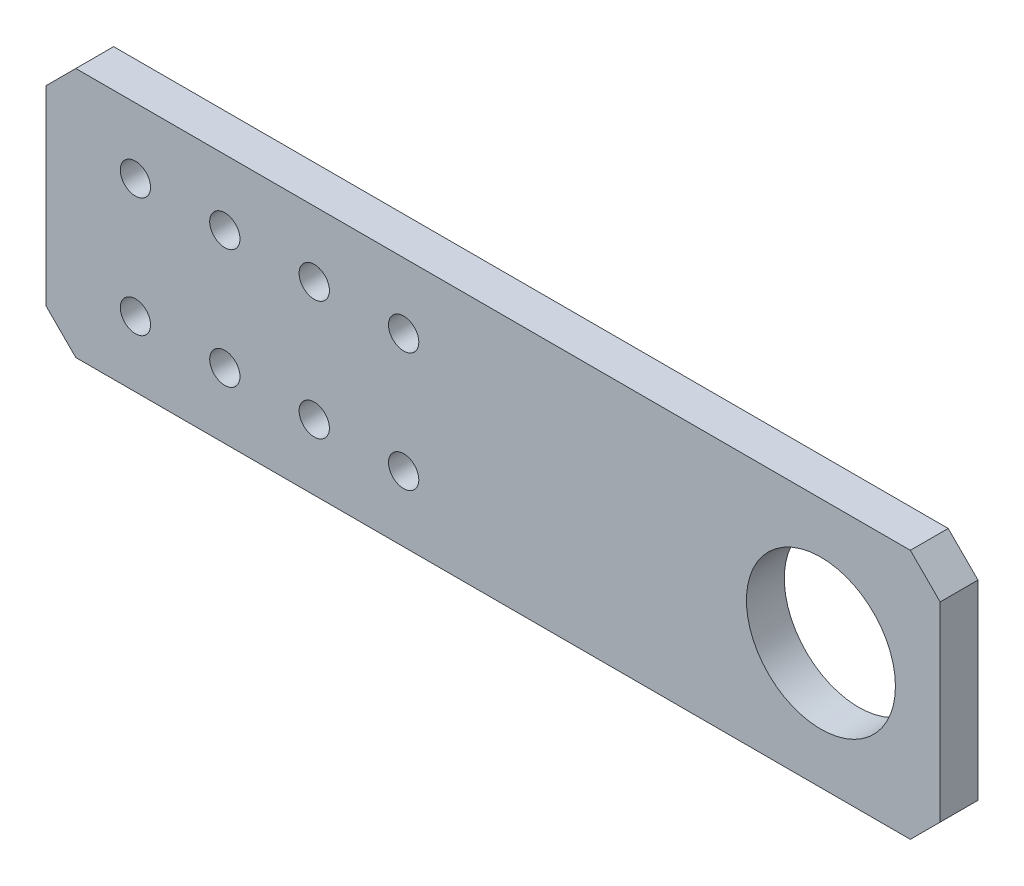
ISO-10303-21;
HEADER;
FILE_DESCRIPTION(('STEP AP214'),'2;1');
FILE_NAME('part.step','',(''),(''),'','','');
FILE_SCHEMA(('AUTOMOTIVE_DESIGN { 1 0 10303 214 1 1 1 1 }'));
ENDSEC;
DATA;
#1=APPLICATION_CONTEXT('core data for automotive mechanical design processes');
#2=APPLICATION_PROTOCOL_DEFINITION('international standard','automotive_design',2000,#1);
#3=PRODUCT_CONTEXT('',#1,'mechanical');
#4=PRODUCT('Part','Part','',(#3));
#5=PRODUCT_RELATED_PRODUCT_CATEGORY('part','',(#4));
#6=PRODUCT_DEFINITION_FORMATION('','',#4);
#7=PRODUCT_DEFINITION_CONTEXT('part definition',#1,'design');
#8=PRODUCT_DEFINITION('design','',#6,#7);
#9=PRODUCT_DEFINITION_SHAPE('','',#8);
#10=(LENGTH_UNIT() NAMED_UNIT(*) SI_UNIT(.MILLI.,.METRE.));
#11=(NAMED_UNIT(*) PLANE_ANGLE_UNIT() SI_UNIT($,.RADIAN.));
#12=(NAMED_UNIT(*) SI_UNIT($,.STERADIAN.) SOLID_ANGLE_UNIT());
#13=UNCERTAINTY_MEASURE_WITH_UNIT(LENGTH_MEASURE(1.E-05),#10,'distance_accuracy_value','');
#14=(GEOMETRIC_REPRESENTATION_CONTEXT(3) GLOBAL_UNCERTAINTY_ASSIGNED_CONTEXT((#13)) GLOBAL_UNIT_ASSIGNED_CONTEXT((#10,
#11,#12)) REPRESENTATION_CONTEXT('',''));
#15=CARTESIAN_POINT('',(0.,0.,0.));
#16=DIRECTION('',(0.,0.,1.));
#17=DIRECTION('',(1.,0.,0.));
#18=AXIS2_PLACEMENT_3D('',#15,#16,#17);
#19=CARTESIAN_POINT('',(-100.,21.,6.35));
#20=DIRECTION('',(0.,-1.,0.));
#21=DIRECTION('',(0.,0.,-1.));
#22=AXIS2_PLACEMENT_3D('',#19,#20,#21);
#23=PLANE('',#22);
#24=DIRECTION('',(0.,0.,1.));
#25=VECTOR('',#24,1.);
#26=CARTESIAN_POINT('',(-45.,21.,-3.65));
#27=LINE('',#26,#25);
#28=CARTESIAN_POINT('',(-45.,21.,0.));
#29=VERTEX_POINT('',#28);
#30=CARTESIAN_POINT('',(-45.,21.,6.35));
#31=VERTEX_POINT('',#30);
#32=EDGE_CURVE('E121',#29,#31,#27,.T.);
#33=ORIENTED_EDGE('',*,*,#32,.T.);
#34=DIRECTION('',(-1.,0.,0.));
#35=VECTOR('',#34,1.);
#36=CARTESIAN_POINT('',(-100.,21.,6.35));
#37=LINE('',#36,#35);
#38=CARTESIAN_POINT('',(95.,21.,6.35));
#39=VERTEX_POINT('',#38);
#40=EDGE_CURVE('E159',#39,#31,#37,.T.);
#41=ORIENTED_EDGE('',*,*,#40,.F.);
#42=DIRECTION('',(0.,0.,-1.));
#43=VECTOR('',#42,1.);
#44=CARTESIAN_POINT('',(95.,21.,6.35));
#45=LINE('',#44,#43);
#46=CARTESIAN_POINT('',(95.,21.,0.));
#47=VERTEX_POINT('',#46);
#48=EDGE_CURVE('E174',#39,#47,#45,.T.);
#49=ORIENTED_EDGE('',*,*,#48,.T.);
#50=DIRECTION('',(-1.,0.,0.));
#51=VECTOR('',#50,1.);
#52=CARTESIAN_POINT('',(-100.,21.,0.));
#53=LINE('',#52,#51);
#54=EDGE_CURVE('E166',#47,#29,#53,.T.);
#55=ORIENTED_EDGE('',*,*,#54,.T.);
#56=EDGE_LOOP('',(#33,#41,#49,#55));
#57=FACE_BOUND('',#56,.T.);
#58=ADVANCED_FACE('F33',(#57),#23,.F.);
#59=CARTESIAN_POINT('',(-100.,-21.,6.35));
#60=DIRECTION('',(0.,1.,0.));
#61=DIRECTION('',(0.,0.,1.));
#62=AXIS2_PLACEMENT_3D('',#59,#60,#61);
#63=PLANE('',#62);
#64=DIRECTION('',(0.,0.,1.));
#65=VECTOR('',#64,1.);
#66=CARTESIAN_POINT('',(-45.,-21.,-3.65));
#67=LINE('',#66,#65);
#68=CARTESIAN_POINT('',(-45.,-21.,0.));
#69=VERTEX_POINT('',#68);
#70=CARTESIAN_POINT('',(-45.,-21.,6.35));
#71=VERTEX_POINT('',#70);
#72=EDGE_CURVE('E111',#69,#71,#67,.T.);
#73=ORIENTED_EDGE('',*,*,#72,.F.);
#74=DIRECTION('',(1.,0.,0.));
#75=VECTOR('',#74,1.);
#76=CARTESIAN_POINT('',(-100.,-21.,0.));
#77=LINE('',#76,#75);
#78=CARTESIAN_POINT('',(95.,-21.,0.));
#79=VERTEX_POINT('',#78);
#80=EDGE_CURVE('E160',#69,#79,#77,.T.);
#81=ORIENTED_EDGE('',*,*,#80,.T.);
#82=DIRECTION('',(0.,0.,1.));
#83=VECTOR('',#82,1.);
#84=CARTESIAN_POINT('',(95.,-21.,6.35));
#85=LINE('',#84,#83);
#86=CARTESIAN_POINT('',(95.,-21.,6.35));
#87=VERTEX_POINT('',#86);
#88=EDGE_CURVE('E181',#79,#87,#85,.T.);
#89=ORIENTED_EDGE('',*,*,#88,.T.);
#90=DIRECTION('',(1.,0.,0.));
#91=VECTOR('',#90,1.);
#92=CARTESIAN_POINT('',(-100.,-21.,6.35));
#93=LINE('',#92,#91);
#94=EDGE_CURVE('E56',#71,#87,#93,.T.);
#95=ORIENTED_EDGE('',*,*,#94,.F.);
#96=EDGE_LOOP('',(#73,#81,#89,#95));
#97=FACE_BOUND('',#96,.T.);
#98=ADVANCED_FACE('F218',(#97),#63,.F.);
#99=CARTESIAN_POINT('',(0.,0.,6.35));
#100=DIRECTION('',(0.,0.,1.));
#101=DIRECTION('',(1.,0.,0.));
#102=AXIS2_PLACEMENT_3D('',#99,#100,#101);
#103=PLANE('',#102);
#104=CARTESIAN_POINT('',(80.,0.,6.35));
#105=DIRECTION('',(0.,0.,1.));
#106=DIRECTION('',(1.,0.,0.));
#107=AXIS2_PLACEMENT_3D('',#104,#105,#106);
#108=CIRCLE('',#107,12.5);
#109=CARTESIAN_POINT('',(92.5,0.,6.35));
#110=VERTEX_POINT('',#109);
#111=EDGE_CURVE('E152',#110,#110,#108,.T.);
#112=ORIENTED_EDGE('',*,*,#111,.F.);
#113=EDGE_LOOP('',(#112));
#114=FACE_BOUND('',#113,.T.);
#115=CARTESIAN_POINT('',(-34.9999999999998,-10.,6.35));
#116=DIRECTION('',(0.,0.,1.));
#117=DIRECTION('',(1.,0.,0.));
#118=AXIS2_PLACEMENT_3D('',#115,#116,#117);
#119=CIRCLE('',#118,2.54);
#120=CARTESIAN_POINT('',(-32.4599999999998,-10.,6.35));
#121=VERTEX_POINT('',#120);
#122=EDGE_CURVE('E112',#121,#121,#119,.T.);
#123=ORIENTED_EDGE('',*,*,#122,.F.);
#124=EDGE_LOOP('',(#123));
#125=FACE_BOUND('',#124,.T.);
#126=CARTESIAN_POINT('',(-35.,10.,6.35));
#127=DIRECTION('',(0.,0.,1.));
#128=DIRECTION('',(1.,0.,0.));
#129=AXIS2_PLACEMENT_3D('',#126,#127,#128);
#130=CIRCLE('',#129,2.54);
#131=CARTESIAN_POINT('',(-32.46,10.,6.35));
#132=VERTEX_POINT('',#131);
#133=EDGE_CURVE('E140',#132,#132,#130,.T.);
#134=ORIENTED_EDGE('',*,*,#133,.F.);
#135=EDGE_LOOP('',(#134));
#136=FACE_BOUND('',#135,.T.);
#137=CARTESIAN_POINT('',(-20.,10.,6.35));
#138=DIRECTION('',(0.,0.,1.));
#139=DIRECTION('',(1.,0.,0.));
#140=AXIS2_PLACEMENT_3D('',#137,#138,#139);
#141=CIRCLE('',#140,2.54);
#142=CARTESIAN_POINT('',(-17.46,10.,6.35));
#143=VERTEX_POINT('',#142);
#144=EDGE_CURVE('E143',#143,#143,#141,.T.);
#145=ORIENTED_EDGE('',*,*,#144,.F.);
#146=EDGE_LOOP('',(#145));
#147=FACE_BOUND('',#146,.T.);
#148=CARTESIAN_POINT('',(-5.,10.,6.35));
#149=DIRECTION('',(0.,0.,1.));
#150=DIRECTION('',(1.,0.,0.));
#151=AXIS2_PLACEMENT_3D('',#148,#149,#150);
#152=CIRCLE('',#151,2.54);
#153=CARTESIAN_POINT('',(-2.46,10.,6.35));
#154=VERTEX_POINT('',#153);
#155=EDGE_CURVE('E128',#154,#154,#152,.T.);
#156=ORIENTED_EDGE('',*,*,#155,.F.);
#157=EDGE_LOOP('',(#156));
#158=FACE_BOUND('',#157,.T.);
#159=CARTESIAN_POINT('',(10.,10.,6.35));
#160=DIRECTION('',(0.,0.,1.));
#161=DIRECTION('',(1.,0.,0.));
#162=AXIS2_PLACEMENT_3D('',#159,#160,#161);
#163=CIRCLE('',#162,2.54);
#164=CARTESIAN_POINT('',(12.54,10.,6.35));
#165=VERTEX_POINT('',#164);
#166=EDGE_CURVE('E125',#165,#165,#163,.T.);
#167=ORIENTED_EDGE('',*,*,#166,.F.);
#168=EDGE_LOOP('',(#167));
#169=FACE_BOUND('',#168,.T.);
#170=CARTESIAN_POINT('',(10.0000000000002,-10.,6.35));
#171=DIRECTION('',(0.,0.,1.));
#172=DIRECTION('',(1.,0.,0.));
#173=AXIS2_PLACEMENT_3D('',#170,#171,#172);
#174=CIRCLE('',#173,2.54);
#175=CARTESIAN_POINT('',(12.5400000000002,-10.,6.35));
#176=VERTEX_POINT('',#175);
#177=EDGE_CURVE('E129',#176,#176,#174,.T.);
#178=ORIENTED_EDGE('',*,*,#177,.F.);
#179=EDGE_LOOP('',(#178));
#180=FACE_BOUND('',#179,.T.);
#181=CARTESIAN_POINT('',(-4.99999999999979,-10.,6.35));
#182=DIRECTION('',(0.,0.,1.));
#183=DIRECTION('',(1.,0.,0.));
#184=AXIS2_PLACEMENT_3D('',#181,#182,#183);
#185=CIRCLE('',#184,2.54);
#186=CARTESIAN_POINT('',(-2.45999999999979,-10.,6.35));
#187=VERTEX_POINT('',#186);
#188=EDGE_CURVE('E132',#187,#187,#185,.T.);
#189=ORIENTED_EDGE('',*,*,#188,.F.);
#190=EDGE_LOOP('',(#189));
#191=FACE_BOUND('',#190,.T.);
#192=CARTESIAN_POINT('',(-19.9999999999998,-10.,6.35));
#193=DIRECTION('',(0.,0.,1.));
#194=DIRECTION('',(1.,0.,0.));
#195=AXIS2_PLACEMENT_3D('',#192,#193,#194);
#196=CIRCLE('',#195,2.54);
#197=CARTESIAN_POINT('',(-17.4599999999998,-10.,6.35));
#198=VERTEX_POINT('',#197);
#199=EDGE_CURVE('E135',#198,#198,#196,.T.);
#200=ORIENTED_EDGE('',*,*,#199,.F.);
#201=EDGE_LOOP('',(#200));
#202=FACE_BOUND('',#201,.T.);
#203=DIRECTION('',(0.,-1.,0.));
#204=VECTOR('',#203,1.);
#205=CARTESIAN_POINT('',(-50.,0.,6.35));
#206=LINE('',#205,#204);
#207=CARTESIAN_POINT('',(-50.,16.,6.35));
#208=VERTEX_POINT('',#207);
#209=CARTESIAN_POINT('',(-50.,-16.,6.35));
#210=VERTEX_POINT('',#209);
#211=EDGE_CURVE('E100',#208,#210,#206,.T.);
#212=ORIENTED_EDGE('',*,*,#211,.T.);
#213=DIRECTION('',(0.707106781186547,-0.707106781186548,0.));
#214=VECTOR('',#213,1.);
#215=CARTESIAN_POINT('',(-33.,-33.,6.35));
#216=LINE('',#215,#214);
#217=EDGE_CURVE('E108',#210,#71,#216,.T.);
#218=ORIENTED_EDGE('',*,*,#217,.T.);
#219=ORIENTED_EDGE('',*,*,#94,.T.);
#220=DIRECTION('',(-0.707106781186549,-0.707106781186546,0.));
#221=VECTOR('',#220,1.);
#222=CARTESIAN_POINT('',(57.9999999999997,-58.,6.35));
#223=LINE('',#222,#221);
#224=CARTESIAN_POINT('',(100.,-16.,6.35));
#225=VERTEX_POINT('',#224);
#226=EDGE_CURVE('E177',#87,#225,#223,.F.);
#227=ORIENTED_EDGE('',*,*,#226,.T.);
#228=DIRECTION('',(0.,1.,0.));
#229=VECTOR('',#228,1.);
#230=CARTESIAN_POINT('',(100.,21.,6.35));
#231=LINE('',#230,#229);
#232=CARTESIAN_POINT('',(100.,16.,6.35));
#233=VERTEX_POINT('',#232);
#234=EDGE_CURVE('E156',#225,#233,#231,.T.);
#235=ORIENTED_EDGE('',*,*,#234,.T.);
#236=DIRECTION('',(0.707106781186546,-0.707106781186549,0.));
#237=VECTOR('',#236,1.);
#238=CARTESIAN_POINT('',(58.0000000000003,58.,6.35));
#239=LINE('',#238,#237);
#240=EDGE_CURVE('E179',#233,#39,#239,.F.);
#241=ORIENTED_EDGE('',*,*,#240,.T.);
#242=ORIENTED_EDGE('',*,*,#40,.T.);
#243=DIRECTION('',(-0.707106781186547,-0.707106781186548,0.));
#244=VECTOR('',#243,1.);
#245=CARTESIAN_POINT('',(-33.,33.,6.35));
#246=LINE('',#245,#244);
#247=EDGE_CURVE('E106',#31,#208,#246,.T.);
#248=ORIENTED_EDGE('',*,*,#247,.T.);
#249=EDGE_LOOP('',(#212,#218,#219,#227,#235,#241,#242,#248));
#250=FACE_BOUND('',#249,.T.);
#251=ADVANCED_FACE('F114',(#114,#125,#136,#147,#158,#169,#180,#191,#202,#250),#103,.T.);
#252=CARTESIAN_POINT('',(0.,0.,0.));
#253=DIRECTION('',(0.,0.,1.));
#254=DIRECTION('',(1.,0.,0.));
#255=AXIS2_PLACEMENT_3D('',#252,#253,#254);
#256=PLANE('',#255);
#257=CARTESIAN_POINT('',(80.,0.,0.));
#258=DIRECTION('',(0.,0.,1.));
#259=DIRECTION('',(1.,0.,0.));
#260=AXIS2_PLACEMENT_3D('',#257,#258,#259);
#261=CIRCLE('',#260,12.5);
#262=CARTESIAN_POINT('',(92.5,0.,0.));
#263=VERTEX_POINT('',#262);
#264=EDGE_CURVE('E148',#263,#263,#261,.T.);
#265=ORIENTED_EDGE('',*,*,#264,.T.);
#266=EDGE_LOOP('',(#265));
#267=FACE_BOUND('',#266,.T.);
#268=CARTESIAN_POINT('',(-34.9999999999998,-10.,0.));
#269=DIRECTION('',(0.,0.,1.));
#270=DIRECTION('',(1.,0.,0.));
#271=AXIS2_PLACEMENT_3D('',#268,#269,#270);
#272=CIRCLE('',#271,2.54);
#273=CARTESIAN_POINT('',(-32.4599999999998,-10.,0.));
#274=VERTEX_POINT('',#273);
#275=EDGE_CURVE('E120',#274,#274,#272,.T.);
#276=ORIENTED_EDGE('',*,*,#275,.T.);
#277=EDGE_LOOP('',(#276));
#278=FACE_BOUND('',#277,.T.);
#279=CARTESIAN_POINT('',(-35.,10.,0.));
#280=DIRECTION('',(0.,0.,1.));
#281=DIRECTION('',(1.,0.,0.));
#282=AXIS2_PLACEMENT_3D('',#279,#280,#281);
#283=CIRCLE('',#282,2.54);
#284=CARTESIAN_POINT('',(-32.46,10.,0.));
#285=VERTEX_POINT('',#284);
#286=EDGE_CURVE('E190',#285,#285,#283,.T.);
#287=ORIENTED_EDGE('',*,*,#286,.T.);
#288=EDGE_LOOP('',(#287));
#289=FACE_BOUND('',#288,.T.);
#290=CARTESIAN_POINT('',(-20.,10.,0.));
#291=DIRECTION('',(0.,0.,1.));
#292=DIRECTION('',(1.,0.,0.));
#293=AXIS2_PLACEMENT_3D('',#290,#291,#292);
#294=CIRCLE('',#293,2.54);
#295=CARTESIAN_POINT('',(-17.46,10.,0.));
#296=VERTEX_POINT('',#295);
#297=EDGE_CURVE('E193',#296,#296,#294,.T.);
#298=ORIENTED_EDGE('',*,*,#297,.T.);
#299=EDGE_LOOP('',(#298));
#300=FACE_BOUND('',#299,.T.);
#301=CARTESIAN_POINT('',(-5.,10.,0.));
#302=DIRECTION('',(0.,0.,1.));
#303=DIRECTION('',(1.,0.,0.));
#304=AXIS2_PLACEMENT_3D('',#301,#302,#303);
#305=CIRCLE('',#304,2.54);
#306=CARTESIAN_POINT('',(-2.46,10.,0.));
#307=VERTEX_POINT('',#306);
#308=EDGE_CURVE('E196',#307,#307,#305,.T.);
#309=ORIENTED_EDGE('',*,*,#308,.T.);
#310=EDGE_LOOP('',(#309));
#311=FACE_BOUND('',#310,.T.);
#312=CARTESIAN_POINT('',(10.,10.,0.));
#313=DIRECTION('',(0.,0.,1.));
#314=DIRECTION('',(1.,0.,0.));
#315=AXIS2_PLACEMENT_3D('',#312,#313,#314);
#316=CIRCLE('',#315,2.54);
#317=CARTESIAN_POINT('',(12.54,10.,0.));
#318=VERTEX_POINT('',#317);
#319=EDGE_CURVE('E199',#318,#318,#316,.T.);
#320=ORIENTED_EDGE('',*,*,#319,.T.);
#321=EDGE_LOOP('',(#320));
#322=FACE_BOUND('',#321,.T.);
#323=CARTESIAN_POINT('',(10.0000000000002,-10.,0.));
#324=DIRECTION('',(0.,0.,1.));
#325=DIRECTION('',(1.,0.,0.));
#326=AXIS2_PLACEMENT_3D('',#323,#324,#325);
#327=CIRCLE('',#326,2.54);
#328=CARTESIAN_POINT('',(12.5400000000002,-10.,0.));
#329=VERTEX_POINT('',#328);
#330=EDGE_CURVE('E202',#329,#329,#327,.T.);
#331=ORIENTED_EDGE('',*,*,#330,.T.);
#332=EDGE_LOOP('',(#331));
#333=FACE_BOUND('',#332,.T.);
#334=CARTESIAN_POINT('',(-4.99999999999979,-10.,0.));
#335=DIRECTION('',(0.,0.,1.));
#336=DIRECTION('',(1.,0.,0.));
#337=AXIS2_PLACEMENT_3D('',#334,#335,#336);
#338=CIRCLE('',#337,2.54);
#339=CARTESIAN_POINT('',(-2.45999999999979,-10.,0.));
#340=VERTEX_POINT('',#339);
#341=EDGE_CURVE('E205',#340,#340,#338,.T.);
#342=ORIENTED_EDGE('',*,*,#341,.T.);
#343=EDGE_LOOP('',(#342));
#344=FACE_BOUND('',#343,.T.);
#345=CARTESIAN_POINT('',(-19.9999999999998,-10.,0.));
#346=DIRECTION('',(0.,0.,1.));
#347=DIRECTION('',(1.,0.,0.));
#348=AXIS2_PLACEMENT_3D('',#345,#346,#347);
#349=CIRCLE('',#348,2.54);
#350=CARTESIAN_POINT('',(-17.4599999999998,-10.,0.));
#351=VERTEX_POINT('',#350);
#352=EDGE_CURVE('E155',#351,#351,#349,.T.);
#353=ORIENTED_EDGE('',*,*,#352,.T.);
#354=EDGE_LOOP('',(#353));
#355=FACE_BOUND('',#354,.T.);
#356=DIRECTION('',(0.707106781186547,-0.707106781186548,0.));
#357=VECTOR('',#356,1.);
#358=CARTESIAN_POINT('',(-33.,-33.,0.));
#359=LINE('',#358,#357);
#360=CARTESIAN_POINT('',(-50.,-16.,0.));
#361=VERTEX_POINT('',#360);
#362=EDGE_CURVE('E11',#361,#69,#359,.T.);
#363=ORIENTED_EDGE('',*,*,#362,.F.);
#364=DIRECTION('',(0.,-1.,0.));
#365=VECTOR('',#364,1.);
#366=CARTESIAN_POINT('',(-50.,0.,0.));
#367=LINE('',#366,#365);
#368=CARTESIAN_POINT('',(-50.,16.,0.));
#369=VERTEX_POINT('',#368);
#370=EDGE_CURVE('E103',#369,#361,#367,.T.);
#371=ORIENTED_EDGE('',*,*,#370,.F.);
#372=DIRECTION('',(-0.707106781186547,-0.707106781186548,0.));
#373=VECTOR('',#372,1.);
#374=CARTESIAN_POINT('',(-33.,33.,0.));
#375=LINE('',#374,#373);
#376=EDGE_CURVE('E41',#29,#369,#375,.T.);
#377=ORIENTED_EDGE('',*,*,#376,.F.);
#378=ORIENTED_EDGE('',*,*,#54,.F.);
#379=DIRECTION('',(-0.707106781186546,0.707106781186549,0.));
#380=VECTOR('',#379,1.);
#381=CARTESIAN_POINT('',(95.,21.,0.));
#382=LINE('',#381,#380);
#383=CARTESIAN_POINT('',(100.,16.,0.));
#384=VERTEX_POINT('',#383);
#385=EDGE_CURVE('E172',#47,#384,#382,.F.);
#386=ORIENTED_EDGE('',*,*,#385,.T.);
#387=DIRECTION('',(0.,1.,0.));
#388=VECTOR('',#387,1.);
#389=CARTESIAN_POINT('',(100.,21.,0.));
#390=LINE('',#389,#388);
#391=CARTESIAN_POINT('',(100.,-16.,0.));
#392=VERTEX_POINT('',#391);
#393=EDGE_CURVE('E151',#392,#384,#390,.T.);
#394=ORIENTED_EDGE('',*,*,#393,.F.);
#395=DIRECTION('',(0.707106781186549,0.707106781186546,0.));
#396=VECTOR('',#395,1.);
#397=CARTESIAN_POINT('',(100.,-16.,0.));
#398=LINE('',#397,#396);
#399=EDGE_CURVE('E163',#392,#79,#398,.F.);
#400=ORIENTED_EDGE('',*,*,#399,.T.);
#401=ORIENTED_EDGE('',*,*,#80,.F.);
#402=EDGE_LOOP('',(#363,#371,#377,#378,#386,#394,#400,#401));
#403=FACE_BOUND('',#402,.T.);
#404=ADVANCED_FACE('F215',(#267,#278,#289,#300,#311,#322,#333,#344,#355,#403),#256,.F.);
#405=CARTESIAN_POINT('',(100.,21.,6.35));
#406=DIRECTION('',(-1.,0.,0.));
#407=DIRECTION('',(0.,0.,1.));
#408=AXIS2_PLACEMENT_3D('',#405,#406,#407);
#409=PLANE('',#408);
#410=ORIENTED_EDGE('',*,*,#393,.T.);
#411=DIRECTION('',(0.,0.,1.));
#412=VECTOR('',#411,1.);
#413=CARTESIAN_POINT('',(100.,16.,6.35));
#414=LINE('',#413,#412);
#415=EDGE_CURVE('E186',#384,#233,#414,.T.);
#416=ORIENTED_EDGE('',*,*,#415,.T.);
#417=ORIENTED_EDGE('',*,*,#234,.F.);
#418=DIRECTION('',(0.,0.,-1.));
#419=VECTOR('',#418,1.);
#420=CARTESIAN_POINT('',(100.,-16.,6.35));
#421=LINE('',#420,#419);
#422=EDGE_CURVE('E183',#225,#392,#421,.T.);
#423=ORIENTED_EDGE('',*,*,#422,.T.);
#424=EDGE_LOOP('',(#410,#416,#417,#423));
#425=FACE_BOUND('',#424,.T.);
#426=ADVANCED_FACE('F226',(#425),#409,.F.);
#427=CARTESIAN_POINT('',(95.,21.,6.35));
#428=DIRECTION('',(-0.707106781186549,-0.707106781186545,0.));
#429=DIRECTION('',(0.,0.,-1.));
#430=AXIS2_PLACEMENT_3D('',#427,#428,#429);
#431=PLANE('',#430);
#432=ORIENTED_EDGE('',*,*,#240,.F.);
#433=ORIENTED_EDGE('',*,*,#415,.F.);
#434=ORIENTED_EDGE('',*,*,#385,.F.);
#435=ORIENTED_EDGE('',*,*,#48,.F.);
#436=EDGE_LOOP('',(#432,#433,#434,#435));
#437=FACE_BOUND('',#436,.T.);
#438=ADVANCED_FACE('F230',(#437),#431,.F.);
#439=CARTESIAN_POINT('',(100.,-16.,6.35));
#440=DIRECTION('',(-0.707106781186546,0.707106781186549,0.));
#441=DIRECTION('',(0.,0.,-1.));
#442=AXIS2_PLACEMENT_3D('',#439,#440,#441);
#443=PLANE('',#442);
#444=ORIENTED_EDGE('',*,*,#226,.F.);
#445=ORIENTED_EDGE('',*,*,#88,.F.);
#446=ORIENTED_EDGE('',*,*,#399,.F.);
#447=ORIENTED_EDGE('',*,*,#422,.F.);
#448=EDGE_LOOP('',(#444,#445,#446,#447));
#449=FACE_BOUND('',#448,.T.);
#450=ADVANCED_FACE('F35',(#449),#443,.F.);
#451=CARTESIAN_POINT('',(80.,0.,0.));
#452=DIRECTION('',(0.,0.,1.));
#453=DIRECTION('',(1.,0.,0.));
#454=AXIS2_PLACEMENT_3D('',#451,#452,#453);
#455=CYLINDRICAL_SURFACE('',#454,12.5);
#456=ORIENTED_EDGE('',*,*,#264,.F.);
#457=EDGE_LOOP('',(#456));
#458=FACE_BOUND('',#457,.T.);
#459=ORIENTED_EDGE('',*,*,#111,.T.);
#460=EDGE_LOOP('',(#459));
#461=FACE_BOUND('',#460,.T.);
#462=ADVANCED_FACE('F247',(#458,#461),#455,.F.);
#463=CARTESIAN_POINT('',(-34.9999999999998,-10.,-3.65));
#464=DIRECTION('',(0.,0.,1.));
#465=DIRECTION('',(1.,0.,0.));
#466=AXIS2_PLACEMENT_3D('',#463,#464,#465);
#467=CYLINDRICAL_SURFACE('',#466,2.54);
#468=ORIENTED_EDGE('',*,*,#122,.T.);
#469=EDGE_LOOP('',(#468));
#470=FACE_BOUND('',#469,.T.);
#471=ORIENTED_EDGE('',*,*,#275,.F.);
#472=EDGE_LOOP('',(#471));
#473=FACE_BOUND('',#472,.T.);
#474=ADVANCED_FACE('F251',(#470,#473),#467,.F.);
#475=CARTESIAN_POINT('',(-35.,10.,-3.65));
#476=DIRECTION('',(0.,0.,1.));
#477=DIRECTION('',(1.,0.,0.));
#478=AXIS2_PLACEMENT_3D('',#475,#476,#477);
#479=CYLINDRICAL_SURFACE('',#478,2.54);
#480=ORIENTED_EDGE('',*,*,#133,.T.);
#481=EDGE_LOOP('',(#480));
#482=FACE_BOUND('',#481,.T.);
#483=ORIENTED_EDGE('',*,*,#286,.F.);
#484=EDGE_LOOP('',(#483));
#485=FACE_BOUND('',#484,.T.);
#486=ADVANCED_FACE('F257',(#482,#485),#479,.F.);
#487=CARTESIAN_POINT('',(-20.,10.,-3.65));
#488=DIRECTION('',(0.,0.,1.));
#489=DIRECTION('',(1.,0.,0.));
#490=AXIS2_PLACEMENT_3D('',#487,#488,#489);
#491=CYLINDRICAL_SURFACE('',#490,2.54);
#492=ORIENTED_EDGE('',*,*,#144,.T.);
#493=EDGE_LOOP('',(#492));
#494=FACE_BOUND('',#493,.T.);
#495=ORIENTED_EDGE('',*,*,#297,.F.);
#496=EDGE_LOOP('',(#495));
#497=FACE_BOUND('',#496,.T.);
#498=ADVANCED_FACE('F305',(#494,#497),#491,.F.);
#499=CARTESIAN_POINT('',(-5.,10.,-3.65));
#500=DIRECTION('',(0.,0.,1.));
#501=DIRECTION('',(1.,0.,0.));
#502=AXIS2_PLACEMENT_3D('',#499,#500,#501);
#503=CYLINDRICAL_SURFACE('',#502,2.54);
#504=ORIENTED_EDGE('',*,*,#155,.T.);
#505=EDGE_LOOP('',(#504));
#506=FACE_BOUND('',#505,.T.);
#507=ORIENTED_EDGE('',*,*,#308,.F.);
#508=EDGE_LOOP('',(#507));
#509=FACE_BOUND('',#508,.T.);
#510=ADVANCED_FACE('F264',(#506,#509),#503,.F.);
#511=CARTESIAN_POINT('',(10.,10.,-3.65));
#512=DIRECTION('',(0.,0.,1.));
#513=DIRECTION('',(1.,0.,0.));
#514=AXIS2_PLACEMENT_3D('',#511,#512,#513);
#515=CYLINDRICAL_SURFACE('',#514,2.54);
#516=ORIENTED_EDGE('',*,*,#166,.T.);
#517=EDGE_LOOP('',(#516));
#518=FACE_BOUND('',#517,.T.);
#519=ORIENTED_EDGE('',*,*,#319,.F.);
#520=EDGE_LOOP('',(#519));
#521=FACE_BOUND('',#520,.T.);
#522=ADVANCED_FACE('F312',(#518,#521),#515,.F.);
#523=CARTESIAN_POINT('',(10.0000000000002,-10.,-3.65));
#524=DIRECTION('',(0.,0.,1.));
#525=DIRECTION('',(1.,0.,0.));
#526=AXIS2_PLACEMENT_3D('',#523,#524,#525);
#527=CYLINDRICAL_SURFACE('',#526,2.54);
#528=ORIENTED_EDGE('',*,*,#177,.T.);
#529=EDGE_LOOP('',(#528));
#530=FACE_BOUND('',#529,.T.);
#531=ORIENTED_EDGE('',*,*,#330,.F.);
#532=EDGE_LOOP('',(#531));
#533=FACE_BOUND('',#532,.T.);
#534=ADVANCED_FACE('F299',(#530,#533),#527,.F.);
#535=CARTESIAN_POINT('',(-4.99999999999979,-10.,-3.65));
#536=DIRECTION('',(0.,0.,1.));
#537=DIRECTION('',(1.,0.,0.));
#538=AXIS2_PLACEMENT_3D('',#535,#536,#537);
#539=CYLINDRICAL_SURFACE('',#538,2.54);
#540=ORIENTED_EDGE('',*,*,#188,.T.);
#541=EDGE_LOOP('',(#540));
#542=FACE_BOUND('',#541,.T.);
#543=ORIENTED_EDGE('',*,*,#341,.F.);
#544=EDGE_LOOP('',(#543));
#545=FACE_BOUND('',#544,.T.);
#546=ADVANCED_FACE('F291',(#542,#545),#539,.F.);
#547=CARTESIAN_POINT('',(-19.9999999999998,-10.,-3.65));
#548=DIRECTION('',(0.,0.,1.));
#549=DIRECTION('',(1.,0.,0.));
#550=AXIS2_PLACEMENT_3D('',#547,#548,#549);
#551=CYLINDRICAL_SURFACE('',#550,2.54);
#552=ORIENTED_EDGE('',*,*,#199,.T.);
#553=EDGE_LOOP('',(#552));
#554=FACE_BOUND('',#553,.T.);
#555=ORIENTED_EDGE('',*,*,#352,.F.);
#556=EDGE_LOOP('',(#555));
#557=FACE_BOUND('',#556,.T.);
#558=ADVANCED_FACE('F289',(#554,#557),#551,.F.);
#559=CARTESIAN_POINT('',(-33.,-33.,-3.65));
#560=DIRECTION('',(-0.707106781186548,-0.707106781186547,0.));
#561=DIRECTION('',(0.707106781186547,-0.707106781186548,0.));
#562=AXIS2_PLACEMENT_3D('',#559,#560,#561);
#563=PLANE('',#562);
#564=ORIENTED_EDGE('',*,*,#362,.T.);
#565=ORIENTED_EDGE('',*,*,#72,.T.);
#566=ORIENTED_EDGE('',*,*,#217,.F.);
#567=DIRECTION('',(0.,0.,1.));
#568=VECTOR('',#567,1.);
#569=CARTESIAN_POINT('',(-50.,-16.,-3.65));
#570=LINE('',#569,#568);
#571=EDGE_CURVE('E96',#361,#210,#570,.T.);
#572=ORIENTED_EDGE('',*,*,#571,.F.);
#573=EDGE_LOOP('',(#564,#565,#566,#572));
#574=FACE_BOUND('',#573,.T.);
#575=ADVANCED_FACE('F109',(#574),#563,.T.);
#576=CARTESIAN_POINT('',(-33.,33.,-3.65));
#577=DIRECTION('',(-0.707106781186548,0.707106781186547,0.));
#578=DIRECTION('',(-0.707106781186547,-0.707106781186548,0.));
#579=AXIS2_PLACEMENT_3D('',#576,#577,#578);
#580=PLANE('',#579);
#581=ORIENTED_EDGE('',*,*,#376,.T.);
#582=DIRECTION('',(0.,0.,1.));
#583=VECTOR('',#582,1.);
#584=CARTESIAN_POINT('',(-50.,16.,-3.65));
#585=LINE('',#584,#583);
#586=EDGE_CURVE('E48',#369,#208,#585,.T.);
#587=ORIENTED_EDGE('',*,*,#586,.T.);
#588=ORIENTED_EDGE('',*,*,#247,.F.);
#589=ORIENTED_EDGE('',*,*,#32,.F.);
#590=EDGE_LOOP('',(#581,#587,#588,#589));
#591=FACE_BOUND('',#590,.T.);
#592=ADVANCED_FACE('F212',(#591),#580,.T.);
#593=CARTESIAN_POINT('',(-50.,0.,-3.65));
#594=DIRECTION('',(-1.,0.,0.));
#595=DIRECTION('',(0.,-1.,0.));
#596=AXIS2_PLACEMENT_3D('',#593,#594,#595);
#597=PLANE('',#596);
#598=ORIENTED_EDGE('',*,*,#370,.T.);
#599=ORIENTED_EDGE('',*,*,#571,.T.);
#600=ORIENTED_EDGE('',*,*,#211,.F.);
#601=ORIENTED_EDGE('',*,*,#586,.F.);
#602=EDGE_LOOP('',(#598,#599,#600,#601));
#603=FACE_BOUND('',#602,.T.);
#604=ADVANCED_FACE('F98',(#603),#597,.T.);
#605=CLOSED_SHELL('',(#58,#98,#251,#404,#426,#438,#450,#462,#474,#486,#498,#510,#522,#534,#546,
#558,#575,#592,#604));
#606=MANIFOLD_SOLID_BREP('B2',#605);
#607=ADVANCED_BREP_SHAPE_REPRESENTATION('',(#18,#606),#14);
#608=SHAPE_DEFINITION_REPRESENTATION(#9,#607);
ENDSEC;
END-ISO-10303-21;
